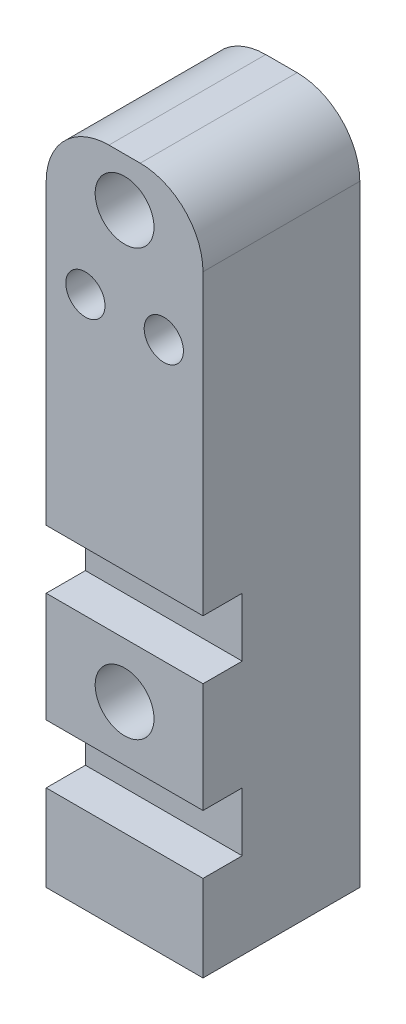
ISO-10303-21;
HEADER;
FILE_DESCRIPTION(('STEP AP214'),'2;1');
FILE_NAME('part.step','',(''),(''),'','','');
FILE_SCHEMA(('AUTOMOTIVE_DESIGN { 1 0 10303 214 1 1 1 1 }'));
ENDSEC;
DATA;
#1=APPLICATION_CONTEXT('core data for automotive mechanical design processes');
#2=APPLICATION_PROTOCOL_DEFINITION('international standard','automotive_design',2000,#1);
#3=PRODUCT_CONTEXT('',#1,'mechanical');
#4=PRODUCT('Part','Part','',(#3));
#5=PRODUCT_RELATED_PRODUCT_CATEGORY('part','',(#4));
#6=PRODUCT_DEFINITION_FORMATION('','',#4);
#7=PRODUCT_DEFINITION_CONTEXT('part definition',#1,'design');
#8=PRODUCT_DEFINITION('design','',#6,#7);
#9=PRODUCT_DEFINITION_SHAPE('','',#8);
#10=(LENGTH_UNIT() NAMED_UNIT(*) SI_UNIT(.MILLI.,.METRE.));
#11=(NAMED_UNIT(*) PLANE_ANGLE_UNIT() SI_UNIT($,.RADIAN.));
#12=(NAMED_UNIT(*) SI_UNIT($,.STERADIAN.) SOLID_ANGLE_UNIT());
#13=UNCERTAINTY_MEASURE_WITH_UNIT(LENGTH_MEASURE(1.E-05),#10,'distance_accuracy_value','');
#14=(GEOMETRIC_REPRESENTATION_CONTEXT(3) GLOBAL_UNCERTAINTY_ASSIGNED_CONTEXT((#13)) GLOBAL_UNIT_ASSIGNED_CONTEXT((#10,
#11,#12)) REPRESENTATION_CONTEXT('',''));
#15=CARTESIAN_POINT('',(0.,0.,0.));
#16=DIRECTION('',(0.,0.,1.));
#17=DIRECTION('',(1.,0.,0.));
#18=AXIS2_PLACEMENT_3D('',#15,#16,#17);
#19=CARTESIAN_POINT('',(0.,0.,0.));
#20=DIRECTION('',(0.,0.,1.));
#21=DIRECTION('',(1.,0.,0.));
#22=AXIS2_PLACEMENT_3D('',#19,#20,#21);
#23=PLANE('',#22);
#24=DIRECTION('',(-1.,0.,0.));
#25=VECTOR('',#24,1.);
#26=CARTESIAN_POINT('',(-12.7,50.8,0.));
#27=LINE('',#26,#25);
#28=CARTESIAN_POINT('',(12.7,50.8,0.));
#29=VERTEX_POINT('',#28);
#30=CARTESIAN_POINT('',(-12.7,50.8,0.));
#31=VERTEX_POINT('',#30);
#32=EDGE_CURVE('E156',#29,#31,#27,.T.);
#33=ORIENTED_EDGE('',*,*,#32,.F.);
#34=DIRECTION('',(0.,1.,0.));
#35=VECTOR('',#34,1.);
#36=CARTESIAN_POINT('',(12.7,0.,0.));
#37=LINE('',#36,#35);
#38=CARTESIAN_POINT('',(12.7,99.0599999999999,0.));
#39=VERTEX_POINT('',#38);
#40=EDGE_CURVE('E250',#29,#39,#37,.T.);
#41=ORIENTED_EDGE('',*,*,#40,.T.);
#42=CARTESIAN_POINT('',(2.54,99.06,0.));
#43=DIRECTION('',(0.,0.,1.));
#44=DIRECTION('',(1.,0.,0.));
#45=AXIS2_PLACEMENT_3D('',#42,#43,#44);
#46=CIRCLE('',#45,10.16);
#47=CARTESIAN_POINT('',(2.53999999999993,109.22,0.));
#48=VERTEX_POINT('',#47);
#49=EDGE_CURVE('E254',#48,#39,#46,.F.);
#50=ORIENTED_EDGE('',*,*,#49,.F.);
#51=DIRECTION('',(1.,0.,0.));
#52=VECTOR('',#51,1.);
#53=CARTESIAN_POINT('',(0.,109.22,0.));
#54=LINE('',#53,#52);
#55=CARTESIAN_POINT('',(-2.53999999999993,109.22,0.));
#56=VERTEX_POINT('',#55);
#57=EDGE_CURVE('E211',#56,#48,#54,.T.);
#58=ORIENTED_EDGE('',*,*,#57,.F.);
#59=CARTESIAN_POINT('',(-2.54,99.06,0.));
#60=DIRECTION('',(0.,0.,1.));
#61=DIRECTION('',(1.,0.,0.));
#62=AXIS2_PLACEMENT_3D('',#59,#60,#61);
#63=CIRCLE('',#62,10.16);
#64=CARTESIAN_POINT('',(-12.7,99.0599999999999,0.));
#65=VERTEX_POINT('',#64);
#66=EDGE_CURVE('E240',#65,#56,#63,.F.);
#67=ORIENTED_EDGE('',*,*,#66,.F.);
#68=DIRECTION('',(0.,1.,0.));
#69=VECTOR('',#68,1.);
#70=CARTESIAN_POINT('',(-12.7,0.,0.));
#71=LINE('',#70,#69);
#72=EDGE_CURVE('E243',#31,#65,#71,.T.);
#73=ORIENTED_EDGE('',*,*,#72,.F.);
#74=EDGE_LOOP('',(#33,#41,#50,#58,#67,#73));
#75=FACE_BOUND('',#74,.T.);
#76=CARTESIAN_POINT('',(-6.35,86.36,0.));
#77=DIRECTION('',(0.,0.,1.));
#78=DIRECTION('',(1.,0.,0.));
#79=AXIS2_PLACEMENT_3D('',#76,#77,#78);
#80=CIRCLE('',#79,3.175);
#81=CARTESIAN_POINT('',(-3.175,86.36,0.));
#82=VERTEX_POINT('',#81);
#83=EDGE_CURVE('E234',#82,#82,#80,.T.);
#84=ORIENTED_EDGE('',*,*,#83,.F.);
#85=EDGE_LOOP('',(#84));
#86=FACE_BOUND('',#85,.T.);
#87=CARTESIAN_POINT('',(6.35,86.36,0.));
#88=DIRECTION('',(0.,0.,1.));
#89=DIRECTION('',(1.,0.,0.));
#90=AXIS2_PLACEMENT_3D('',#87,#88,#89);
#91=CIRCLE('',#90,3.175);
#92=CARTESIAN_POINT('',(9.525,86.36,0.));
#93=VERTEX_POINT('',#92);
#94=EDGE_CURVE('E204',#93,#93,#91,.T.);
#95=ORIENTED_EDGE('',*,*,#94,.F.);
#96=EDGE_LOOP('',(#95));
#97=FACE_BOUND('',#96,.T.);
#98=CARTESIAN_POINT('',(0.,101.346,0.));
#99=DIRECTION('',(0.,0.,1.));
#100=DIRECTION('',(1.,0.,0.));
#101=AXIS2_PLACEMENT_3D('',#98,#99,#100);
#102=CIRCLE('',#101,4.7625);
#103=CARTESIAN_POINT('',(4.7625,101.346,0.));
#104=VERTEX_POINT('',#103);
#105=EDGE_CURVE('E196',#104,#104,#102,.T.);
#106=ORIENTED_EDGE('',*,*,#105,.F.);
#107=EDGE_LOOP('',(#106));
#108=FACE_BOUND('',#107,.T.);
#109=ADVANCED_FACE('F38',(#75,#86,#97,#108),#23,.T.);
#110=DIRECTION('',(1.,0.,0.));
#111=VECTOR('',#110,1.);
#112=CARTESIAN_POINT('',(-12.7,41.275,0.));
#113=LINE('',#112,#111);
#114=CARTESIAN_POINT('',(-12.7,41.275,0.));
#115=VERTEX_POINT('',#114);
#116=CARTESIAN_POINT('',(12.7,41.275,0.));
#117=VERTEX_POINT('',#116);
#118=EDGE_CURVE('E186',#115,#117,#113,.T.);
#119=ORIENTED_EDGE('',*,*,#118,.F.);
#120=CARTESIAN_POINT('',(-12.7,23.495,0.));
#121=VERTEX_POINT('',#120);
#122=EDGE_CURVE('E162',#121,#115,#71,.T.);
#123=ORIENTED_EDGE('',*,*,#122,.F.);
#124=DIRECTION('',(-1.,0.,0.));
#125=VECTOR('',#124,1.);
#126=CARTESIAN_POINT('',(-12.7,23.495,0.));
#127=LINE('',#126,#125);
#128=CARTESIAN_POINT('',(12.7,23.495,0.));
#129=VERTEX_POINT('',#128);
#130=EDGE_CURVE('E173',#129,#121,#127,.T.);
#131=ORIENTED_EDGE('',*,*,#130,.F.);
#132=EDGE_CURVE('E255',#129,#117,#37,.T.);
#133=ORIENTED_EDGE('',*,*,#132,.T.);
#134=EDGE_LOOP('',(#119,#123,#131,#133));
#135=FACE_BOUND('',#134,.T.);
#136=CARTESIAN_POINT('',(0.,32.385,0.));
#137=DIRECTION('',(0.,0.,1.));
#138=DIRECTION('',(1.,0.,0.));
#139=AXIS2_PLACEMENT_3D('',#136,#137,#138);
#140=CIRCLE('',#139,4.7625);
#141=CARTESIAN_POINT('',(4.7625,32.385,0.));
#142=VERTEX_POINT('',#141);
#143=EDGE_CURVE('E237',#142,#142,#140,.T.);
#144=ORIENTED_EDGE('',*,*,#143,.F.);
#145=EDGE_LOOP('',(#144));
#146=FACE_BOUND('',#145,.T.);
#147=ADVANCED_FACE('F322',(#135,#146),#23,.T.);
#148=CARTESIAN_POINT('',(-2.54,99.06,-25.4));
#149=DIRECTION('',(0.,0.,1.));
#150=DIRECTION('',(1.,0.,0.));
#151=AXIS2_PLACEMENT_3D('',#148,#149,#150);
#152=CYLINDRICAL_SURFACE('',#151,10.16);
#153=ORIENTED_EDGE('',*,*,#66,.T.);
#154=DIRECTION('',(0.,0.,1.));
#155=VECTOR('',#154,1.);
#156=CARTESIAN_POINT('',(-2.53999999999993,109.22,-25.4));
#157=LINE('',#156,#155);
#158=CARTESIAN_POINT('',(-2.53999999999993,109.22,-25.4));
#159=VERTEX_POINT('',#158);
#160=EDGE_CURVE('E11',#159,#56,#157,.T.);
#161=ORIENTED_EDGE('',*,*,#160,.F.);
#162=CARTESIAN_POINT('',(-2.54,99.06,-25.4));
#163=DIRECTION('',(0.,0.,1.));
#164=DIRECTION('',(1.,0.,0.));
#165=AXIS2_PLACEMENT_3D('',#162,#163,#164);
#166=CIRCLE('',#165,10.16);
#167=CARTESIAN_POINT('',(-12.7,99.0599999999999,-25.4));
#168=VERTEX_POINT('',#167);
#169=EDGE_CURVE('E217',#168,#159,#166,.F.);
#170=ORIENTED_EDGE('',*,*,#169,.F.);
#171=DIRECTION('',(0.,0.,1.));
#172=VECTOR('',#171,1.);
#173=CARTESIAN_POINT('',(-12.7,99.0599999999999,-25.4));
#174=LINE('',#173,#172);
#175=EDGE_CURVE('E42',#168,#65,#174,.T.);
#176=ORIENTED_EDGE('',*,*,#175,.T.);
#177=EDGE_LOOP('',(#153,#161,#170,#176));
#178=FACE_BOUND('',#177,.T.);
#179=ADVANCED_FACE('F273',(#178),#152,.T.);
#180=CARTESIAN_POINT('',(0.,109.22,-25.4));
#181=DIRECTION('',(0.,-1.,0.));
#182=DIRECTION('',(0.,0.,-1.));
#183=AXIS2_PLACEMENT_3D('',#180,#181,#182);
#184=PLANE('',#183);
#185=ORIENTED_EDGE('',*,*,#57,.T.);
#186=DIRECTION('',(0.,0.,1.));
#187=VECTOR('',#186,1.);
#188=CARTESIAN_POINT('',(2.53999999999993,109.22,-25.4));
#189=LINE('',#188,#187);
#190=CARTESIAN_POINT('',(2.53999999999993,109.22,-25.4));
#191=VERTEX_POINT('',#190);
#192=EDGE_CURVE('E47',#191,#48,#189,.T.);
#193=ORIENTED_EDGE('',*,*,#192,.F.);
#194=DIRECTION('',(1.,0.,0.));
#195=VECTOR('',#194,1.);
#196=CARTESIAN_POINT('',(0.,109.22,-25.4));
#197=LINE('',#196,#195);
#198=EDGE_CURVE('E230',#159,#191,#197,.T.);
#199=ORIENTED_EDGE('',*,*,#198,.F.);
#200=ORIENTED_EDGE('',*,*,#160,.T.);
#201=EDGE_LOOP('',(#185,#193,#199,#200));
#202=FACE_BOUND('',#201,.T.);
#203=ADVANCED_FACE('F282',(#202),#184,.F.);
#204=CARTESIAN_POINT('',(2.54,99.06,-25.4));
#205=DIRECTION('',(0.,0.,1.));
#206=DIRECTION('',(1.,0.,0.));
#207=AXIS2_PLACEMENT_3D('',#204,#205,#206);
#208=CYLINDRICAL_SURFACE('',#207,10.16);
#209=ORIENTED_EDGE('',*,*,#49,.T.);
#210=DIRECTION('',(0.,0.,1.));
#211=VECTOR('',#210,1.);
#212=CARTESIAN_POINT('',(12.7,99.0599999999999,-25.4));
#213=LINE('',#212,#211);
#214=CARTESIAN_POINT('',(12.7,99.0599999999999,-25.4));
#215=VERTEX_POINT('',#214);
#216=EDGE_CURVE('E261',#215,#39,#213,.T.);
#217=ORIENTED_EDGE('',*,*,#216,.F.);
#218=CARTESIAN_POINT('',(2.54,99.06,-25.4));
#219=DIRECTION('',(0.,0.,1.));
#220=DIRECTION('',(1.,0.,0.));
#221=AXIS2_PLACEMENT_3D('',#218,#219,#220);
#222=CIRCLE('',#221,10.16);
#223=EDGE_CURVE('E228',#191,#215,#222,.F.);
#224=ORIENTED_EDGE('',*,*,#223,.F.);
#225=ORIENTED_EDGE('',*,*,#192,.T.);
#226=EDGE_LOOP('',(#209,#217,#224,#225));
#227=FACE_BOUND('',#226,.T.);
#228=ADVANCED_FACE('F312',(#227),#208,.T.);
#229=CARTESIAN_POINT('',(12.7,0.,-25.4));
#230=DIRECTION('',(1.,0.,0.));
#231=DIRECTION('',(0.,0.,-1.));
#232=AXIS2_PLACEMENT_3D('',#229,#230,#231);
#233=PLANE('',#232);
#234=DIRECTION('',(0.,0.,1.));
#235=VECTOR('',#234,1.);
#236=CARTESIAN_POINT('',(12.7,50.8,-6.35));
#237=LINE('',#236,#235);
#238=CARTESIAN_POINT('',(12.7,50.8,-6.35));
#239=VERTEX_POINT('',#238);
#240=EDGE_CURVE('E164',#239,#29,#237,.T.);
#241=ORIENTED_EDGE('',*,*,#240,.F.);
#242=DIRECTION('',(0.,1.,0.));
#243=VECTOR('',#242,1.);
#244=CARTESIAN_POINT('',(12.7,41.275,-6.35));
#245=LINE('',#244,#243);
#246=CARTESIAN_POINT('',(12.7,41.275,-6.35));
#247=VERTEX_POINT('',#246);
#248=EDGE_CURVE('E146',#247,#239,#245,.T.);
#249=ORIENTED_EDGE('',*,*,#248,.F.);
#250=DIRECTION('',(0.,0.,1.));
#251=VECTOR('',#250,1.);
#252=CARTESIAN_POINT('',(12.7,41.275,-6.35));
#253=LINE('',#252,#251);
#254=EDGE_CURVE('E143',#247,#117,#253,.T.);
#255=ORIENTED_EDGE('',*,*,#254,.T.);
#256=ORIENTED_EDGE('',*,*,#132,.F.);
#257=DIRECTION('',(0.,0.,1.));
#258=VECTOR('',#257,1.);
#259=CARTESIAN_POINT('',(12.7,23.495,-6.35));
#260=LINE('',#259,#258);
#261=CARTESIAN_POINT('',(12.7,23.495,-6.35));
#262=VERTEX_POINT('',#261);
#263=EDGE_CURVE('E187',#262,#129,#260,.T.);
#264=ORIENTED_EDGE('',*,*,#263,.F.);
#265=DIRECTION('',(0.,1.,0.));
#266=VECTOR('',#265,1.);
#267=CARTESIAN_POINT('',(12.7,13.97,-6.35));
#268=LINE('',#267,#266);
#269=CARTESIAN_POINT('',(12.7,13.97,-6.35));
#270=VERTEX_POINT('',#269);
#271=EDGE_CURVE('E176',#270,#262,#268,.T.);
#272=ORIENTED_EDGE('',*,*,#271,.F.);
#273=DIRECTION('',(0.,0.,1.));
#274=VECTOR('',#273,1.);
#275=CARTESIAN_POINT('',(12.7,13.97,-6.35));
#276=LINE('',#275,#274);
#277=CARTESIAN_POINT('',(12.7,13.97,0.));
#278=VERTEX_POINT('',#277);
#279=EDGE_CURVE('E189',#270,#278,#276,.T.);
#280=ORIENTED_EDGE('',*,*,#279,.T.);
#281=CARTESIAN_POINT('',(12.7,0.,0.));
#282=VERTEX_POINT('',#281);
#283=EDGE_CURVE('E251',#282,#278,#37,.T.);
#284=ORIENTED_EDGE('',*,*,#283,.F.);
#285=DIRECTION('',(0.,0.,1.));
#286=VECTOR('',#285,1.);
#287=CARTESIAN_POINT('',(12.7,0.,-25.4));
#288=LINE('',#287,#286);
#289=CARTESIAN_POINT('',(12.7,0.,-25.4));
#290=VERTEX_POINT('',#289);
#291=EDGE_CURVE('E264',#290,#282,#288,.T.);
#292=ORIENTED_EDGE('',*,*,#291,.F.);
#293=DIRECTION('',(0.,1.,0.));
#294=VECTOR('',#293,1.);
#295=CARTESIAN_POINT('',(12.7,0.,-25.4));
#296=LINE('',#295,#294);
#297=EDGE_CURVE('E225',#290,#215,#296,.T.);
#298=ORIENTED_EDGE('',*,*,#297,.T.);
#299=ORIENTED_EDGE('',*,*,#216,.T.);
#300=ORIENTED_EDGE('',*,*,#40,.F.);
#301=EDGE_LOOP('',(#241,#249,#255,#256,#264,#272,#280,#284,#292,#298,#299,#300));
#302=FACE_BOUND('',#301,.T.);
#303=ADVANCED_FACE('F306',(#302),#233,.T.);
#304=CARTESIAN_POINT('',(0.,0.,-25.4));
#305=DIRECTION('',(0.,-1.,0.));
#306=DIRECTION('',(0.,0.,-1.));
#307=AXIS2_PLACEMENT_3D('',#304,#305,#306);
#308=PLANE('',#307);
#309=CARTESIAN_POINT('',(0.,0.,-12.7));
#310=DIRECTION('',(0.,-1.,0.));
#311=DIRECTION('',(0.,0.,-1.));
#312=AXIS2_PLACEMENT_3D('',#309,#310,#311);
#313=CIRCLE('',#312,3.175);
#314=CARTESIAN_POINT('',(0.,0.,-15.875));
#315=VERTEX_POINT('',#314);
#316=EDGE_CURVE('E197',#315,#315,#313,.T.);
#317=ORIENTED_EDGE('',*,*,#316,.F.);
#318=EDGE_LOOP('',(#317));
#319=FACE_BOUND('',#318,.T.);
#320=DIRECTION('',(1.,0.,0.));
#321=VECTOR('',#320,1.);
#322=CARTESIAN_POINT('',(0.,0.,0.));
#323=LINE('',#322,#321);
#324=CARTESIAN_POINT('',(-12.7,0.,0.));
#325=VERTEX_POINT('',#324);
#326=EDGE_CURVE('E247',#325,#282,#323,.T.);
#327=ORIENTED_EDGE('',*,*,#326,.F.);
#328=DIRECTION('',(0.,0.,1.));
#329=VECTOR('',#328,1.);
#330=CARTESIAN_POINT('',(-12.7,0.,-25.4));
#331=LINE('',#330,#329);
#332=CARTESIAN_POINT('',(-12.7,0.,-25.4));
#333=VERTEX_POINT('',#332);
#334=EDGE_CURVE('E265',#333,#325,#331,.T.);
#335=ORIENTED_EDGE('',*,*,#334,.F.);
#336=DIRECTION('',(1.,0.,0.));
#337=VECTOR('',#336,1.);
#338=CARTESIAN_POINT('',(0.,0.,-25.4));
#339=LINE('',#338,#337);
#340=EDGE_CURVE('E222',#333,#290,#339,.T.);
#341=ORIENTED_EDGE('',*,*,#340,.T.);
#342=ORIENTED_EDGE('',*,*,#291,.T.);
#343=EDGE_LOOP('',(#327,#335,#341,#342));
#344=FACE_BOUND('',#343,.T.);
#345=ADVANCED_FACE('F290',(#319,#344),#308,.T.);
#346=CARTESIAN_POINT('',(0.,32.385,-25.4));
#347=DIRECTION('',(0.,0.,1.));
#348=DIRECTION('',(1.,0.,0.));
#349=AXIS2_PLACEMENT_3D('',#346,#347,#348);
#350=CYLINDRICAL_SURFACE('',#349,4.7625);
#351=CARTESIAN_POINT('',(0.,32.385,-25.4));
#352=DIRECTION('',(0.,0.,1.));
#353=DIRECTION('',(1.,0.,0.));
#354=AXIS2_PLACEMENT_3D('',#351,#352,#353);
#355=CIRCLE('',#354,4.7625);
#356=CARTESIAN_POINT('',(4.7625,32.385,-25.4));
#357=VERTEX_POINT('',#356);
#358=EDGE_CURVE('E214',#357,#357,#355,.T.);
#359=ORIENTED_EDGE('',*,*,#358,.F.);
#360=EDGE_LOOP('',(#359));
#361=FACE_BOUND('',#360,.T.);
#362=ORIENTED_EDGE('',*,*,#143,.T.);
#363=EDGE_LOOP('',(#362));
#364=FACE_BOUND('',#363,.T.);
#365=ADVANCED_FACE('F432',(#361,#364),#350,.F.);
#366=CARTESIAN_POINT('',(-6.35,86.36,-25.4));
#367=DIRECTION('',(0.,0.,1.));
#368=DIRECTION('',(1.,0.,0.));
#369=AXIS2_PLACEMENT_3D('',#366,#367,#368);
#370=CYLINDRICAL_SURFACE('',#369,3.175);
#371=CARTESIAN_POINT('',(-6.35,86.36,-25.4));
#372=DIRECTION('',(0.,0.,1.));
#373=DIRECTION('',(1.,0.,0.));
#374=AXIS2_PLACEMENT_3D('',#371,#372,#373);
#375=CIRCLE('',#374,3.175);
#376=CARTESIAN_POINT('',(-3.175,86.36,-25.4));
#377=VERTEX_POINT('',#376);
#378=EDGE_CURVE('E210',#377,#377,#375,.T.);
#379=ORIENTED_EDGE('',*,*,#378,.F.);
#380=EDGE_LOOP('',(#379));
#381=FACE_BOUND('',#380,.T.);
#382=ORIENTED_EDGE('',*,*,#83,.T.);
#383=EDGE_LOOP('',(#382));
#384=FACE_BOUND('',#383,.T.);
#385=ADVANCED_FACE('F423',(#381,#384),#370,.F.);
#386=CARTESIAN_POINT('',(6.35,86.36,-25.4));
#387=DIRECTION('',(0.,0.,1.));
#388=DIRECTION('',(1.,0.,0.));
#389=AXIS2_PLACEMENT_3D('',#386,#387,#388);
#390=CYLINDRICAL_SURFACE('',#389,3.175);
#391=CARTESIAN_POINT('',(6.35,86.36,-25.4));
#392=DIRECTION('',(0.,0.,1.));
#393=DIRECTION('',(1.,0.,0.));
#394=AXIS2_PLACEMENT_3D('',#391,#392,#393);
#395=CIRCLE('',#394,3.175);
#396=CARTESIAN_POINT('',(9.525,86.36,-25.4));
#397=VERTEX_POINT('',#396);
#398=EDGE_CURVE('E207',#397,#397,#395,.T.);
#399=ORIENTED_EDGE('',*,*,#398,.F.);
#400=EDGE_LOOP('',(#399));
#401=FACE_BOUND('',#400,.T.);
#402=ORIENTED_EDGE('',*,*,#94,.T.);
#403=EDGE_LOOP('',(#402));
#404=FACE_BOUND('',#403,.T.);
#405=ADVANCED_FACE('F40',(#401,#404),#390,.F.);
#406=CARTESIAN_POINT('',(-12.7,0.,-25.4));
#407=DIRECTION('',(1.,0.,0.));
#408=DIRECTION('',(0.,0.,-1.));
#409=AXIS2_PLACEMENT_3D('',#406,#407,#408);
#410=PLANE('',#409);
#411=DIRECTION('',(0.,-1.,0.));
#412=VECTOR('',#411,1.);
#413=CARTESIAN_POINT('',(-12.7,41.275,-6.35));
#414=LINE('',#413,#412);
#415=CARTESIAN_POINT('',(-12.7,50.8,-6.35));
#416=VERTEX_POINT('',#415);
#417=CARTESIAN_POINT('',(-12.7,41.275,-6.35));
#418=VERTEX_POINT('',#417);
#419=EDGE_CURVE('E147',#416,#418,#414,.T.);
#420=ORIENTED_EDGE('',*,*,#419,.F.);
#421=DIRECTION('',(0.,0.,1.));
#422=VECTOR('',#421,1.);
#423=CARTESIAN_POINT('',(-12.7,50.8,-6.35));
#424=LINE('',#423,#422);
#425=EDGE_CURVE('E200',#416,#31,#424,.T.);
#426=ORIENTED_EDGE('',*,*,#425,.T.);
#427=ORIENTED_EDGE('',*,*,#72,.T.);
#428=ORIENTED_EDGE('',*,*,#175,.F.);
#429=DIRECTION('',(0.,1.,0.));
#430=VECTOR('',#429,1.);
#431=CARTESIAN_POINT('',(-12.7,0.,-25.4));
#432=LINE('',#431,#430);
#433=EDGE_CURVE('E220',#333,#168,#432,.T.);
#434=ORIENTED_EDGE('',*,*,#433,.F.);
#435=ORIENTED_EDGE('',*,*,#334,.T.);
#436=CARTESIAN_POINT('',(-12.7,13.97,0.));
#437=VERTEX_POINT('',#436);
#438=EDGE_CURVE('E244',#325,#437,#71,.T.);
#439=ORIENTED_EDGE('',*,*,#438,.T.);
#440=DIRECTION('',(0.,0.,1.));
#441=VECTOR('',#440,1.);
#442=CARTESIAN_POINT('',(-12.7,13.97,-6.35));
#443=LINE('',#442,#441);
#444=CARTESIAN_POINT('',(-12.7,13.97,-6.35));
#445=VERTEX_POINT('',#444);
#446=EDGE_CURVE('E63',#445,#437,#443,.T.);
#447=ORIENTED_EDGE('',*,*,#446,.F.);
#448=DIRECTION('',(0.,-1.,0.));
#449=VECTOR('',#448,1.);
#450=CARTESIAN_POINT('',(-12.7,13.97,-6.35));
#451=LINE('',#450,#449);
#452=CARTESIAN_POINT('',(-12.7,23.495,-6.35));
#453=VERTEX_POINT('',#452);
#454=EDGE_CURVE('E169',#453,#445,#451,.T.);
#455=ORIENTED_EDGE('',*,*,#454,.F.);
#456=DIRECTION('',(0.,0.,1.));
#457=VECTOR('',#456,1.);
#458=CARTESIAN_POINT('',(-12.7,23.495,-6.35));
#459=LINE('',#458,#457);
#460=EDGE_CURVE('E184',#453,#121,#459,.T.);
#461=ORIENTED_EDGE('',*,*,#460,.T.);
#462=ORIENTED_EDGE('',*,*,#122,.T.);
#463=DIRECTION('',(0.,0.,1.));
#464=VECTOR('',#463,1.);
#465=CARTESIAN_POINT('',(-12.7,41.275,-6.35));
#466=LINE('',#465,#464);
#467=EDGE_CURVE('E55',#418,#115,#466,.T.);
#468=ORIENTED_EDGE('',*,*,#467,.F.);
#469=EDGE_LOOP('',(#420,#426,#427,#428,#434,#435,#439,#447,#455,#461,#462,#468));
#470=FACE_BOUND('',#469,.T.);
#471=ADVANCED_FACE('F159',(#470),#410,.F.);
#472=CARTESIAN_POINT('',(0.,0.,-25.4));
#473=DIRECTION('',(0.,0.,1.));
#474=DIRECTION('',(1.,0.,0.));
#475=AXIS2_PLACEMENT_3D('',#472,#473,#474);
#476=PLANE('',#475);
#477=ORIENTED_EDGE('',*,*,#398,.T.);
#478=EDGE_LOOP('',(#477));
#479=FACE_BOUND('',#478,.T.);
#480=ORIENTED_EDGE('',*,*,#378,.T.);
#481=EDGE_LOOP('',(#480));
#482=FACE_BOUND('',#481,.T.);
#483=ORIENTED_EDGE('',*,*,#358,.T.);
#484=EDGE_LOOP('',(#483));
#485=FACE_BOUND('',#484,.T.);
#486=ORIENTED_EDGE('',*,*,#169,.T.);
#487=ORIENTED_EDGE('',*,*,#198,.T.);
#488=ORIENTED_EDGE('',*,*,#223,.T.);
#489=ORIENTED_EDGE('',*,*,#297,.F.);
#490=ORIENTED_EDGE('',*,*,#340,.F.);
#491=ORIENTED_EDGE('',*,*,#433,.T.);
#492=EDGE_LOOP('',(#486,#487,#488,#489,#490,#491));
#493=FACE_BOUND('',#492,.T.);
#494=ADVANCED_FACE('F285',(#479,#482,#485,#493),#476,.F.);
#495=DIRECTION('',(1.,0.,0.));
#496=VECTOR('',#495,1.);
#497=CARTESIAN_POINT('',(-12.7,13.97,0.));
#498=LINE('',#497,#496);
#499=EDGE_CURVE('E181',#437,#278,#498,.T.);
#500=ORIENTED_EDGE('',*,*,#499,.F.);
#501=ORIENTED_EDGE('',*,*,#438,.F.);
#502=ORIENTED_EDGE('',*,*,#326,.T.);
#503=ORIENTED_EDGE('',*,*,#283,.T.);
#504=EDGE_LOOP('',(#500,#501,#502,#503));
#505=FACE_BOUND('',#504,.T.);
#506=ADVANCED_FACE('F293',(#505),#23,.T.);
#507=CARTESIAN_POINT('',(0.,101.346,-16.51));
#508=DIRECTION('',(0.,0.,1.));
#509=DIRECTION('',(1.,0.,0.));
#510=AXIS2_PLACEMENT_3D('',#507,#508,#509);
#511=CYLINDRICAL_SURFACE('',#510,4.7625);
#512=CARTESIAN_POINT('',(0.,101.346,-16.51));
#513=DIRECTION('',(0.,0.,1.));
#514=DIRECTION('',(1.,0.,0.));
#515=AXIS2_PLACEMENT_3D('',#512,#513,#514);
#516=CIRCLE('',#515,4.7625);
#517=CARTESIAN_POINT('',(4.7625,101.346,-16.51));
#518=VERTEX_POINT('',#517);
#519=EDGE_CURVE('E201',#518,#518,#516,.T.);
#520=ORIENTED_EDGE('',*,*,#519,.F.);
#521=EDGE_LOOP('',(#520));
#522=FACE_BOUND('',#521,.T.);
#523=ORIENTED_EDGE('',*,*,#105,.T.);
#524=EDGE_LOOP('',(#523));
#525=FACE_BOUND('',#524,.T.);
#526=ADVANCED_FACE('F329',(#522,#525),#511,.F.);
#527=CARTESIAN_POINT('',(0.,0.,-16.51));
#528=DIRECTION('',(0.,0.,1.));
#529=DIRECTION('',(1.,0.,0.));
#530=AXIS2_PLACEMENT_3D('',#527,#528,#529);
#531=PLANE('',#530);
#532=ORIENTED_EDGE('',*,*,#519,.T.);
#533=EDGE_LOOP('',(#532));
#534=FACE_BOUND('',#533,.T.);
#535=ADVANCED_FACE('F334',(#534),#531,.T.);
#536=CARTESIAN_POINT('',(0.,17.78,-12.7));
#537=DIRECTION('',(0.,-1.,0.));
#538=DIRECTION('',(0.,0.,-1.));
#539=AXIS2_PLACEMENT_3D('',#536,#537,#538);
#540=CYLINDRICAL_SURFACE('',#539,3.175);
#541=CARTESIAN_POINT('',(0.,17.78,-12.7));
#542=DIRECTION('',(0.,-1.,0.));
#543=DIRECTION('',(0.,0.,-1.));
#544=AXIS2_PLACEMENT_3D('',#541,#542,#543);
#545=CIRCLE('',#544,3.175);
#546=CARTESIAN_POINT('',(0.,17.78,-15.875));
#547=VERTEX_POINT('',#546);
#548=EDGE_CURVE('E193',#547,#547,#545,.T.);
#549=ORIENTED_EDGE('',*,*,#548,.F.);
#550=EDGE_LOOP('',(#549));
#551=FACE_BOUND('',#550,.T.);
#552=ORIENTED_EDGE('',*,*,#316,.T.);
#553=EDGE_LOOP('',(#552));
#554=FACE_BOUND('',#553,.T.);
#555=ADVANCED_FACE('F346',(#551,#554),#540,.F.);
#556=CARTESIAN_POINT('',(0.,17.78,-12.7));
#557=DIRECTION('',(0.,-1.,0.));
#558=DIRECTION('',(0.,0.,-1.));
#559=AXIS2_PLACEMENT_3D('',#556,#557,#558);
#560=PLANE('',#559);
#561=ORIENTED_EDGE('',*,*,#548,.T.);
#562=EDGE_LOOP('',(#561));
#563=FACE_BOUND('',#562,.T.);
#564=ADVANCED_FACE('F350',(#563),#560,.T.);
#565=CARTESIAN_POINT('',(-12.7,23.495,-6.35));
#566=DIRECTION('',(0.,1.,0.));
#567=DIRECTION('',(0.,0.,1.));
#568=AXIS2_PLACEMENT_3D('',#565,#566,#567);
#569=PLANE('',#568);
#570=ORIENTED_EDGE('',*,*,#130,.T.);
#571=ORIENTED_EDGE('',*,*,#460,.F.);
#572=DIRECTION('',(-1.,0.,0.));
#573=VECTOR('',#572,1.);
#574=CARTESIAN_POINT('',(-12.7,23.495,-6.35));
#575=LINE('',#574,#573);
#576=EDGE_CURVE('E178',#262,#453,#575,.T.);
#577=ORIENTED_EDGE('',*,*,#576,.F.);
#578=ORIENTED_EDGE('',*,*,#263,.T.);
#579=EDGE_LOOP('',(#570,#571,#577,#578));
#580=FACE_BOUND('',#579,.T.);
#581=ADVANCED_FACE('F301',(#580),#569,.F.);
#582=CARTESIAN_POINT('',(-12.7,13.97,-6.35));
#583=DIRECTION('',(0.,-1.,0.));
#584=DIRECTION('',(0.,0.,-1.));
#585=AXIS2_PLACEMENT_3D('',#582,#583,#584);
#586=PLANE('',#585);
#587=ORIENTED_EDGE('',*,*,#499,.T.);
#588=ORIENTED_EDGE('',*,*,#279,.F.);
#589=DIRECTION('',(1.,0.,0.));
#590=VECTOR('',#589,1.);
#591=CARTESIAN_POINT('',(-12.7,13.97,-6.35));
#592=LINE('',#591,#590);
#593=EDGE_CURVE('E172',#445,#270,#592,.T.);
#594=ORIENTED_EDGE('',*,*,#593,.F.);
#595=ORIENTED_EDGE('',*,*,#446,.T.);
#596=EDGE_LOOP('',(#587,#588,#594,#595));
#597=FACE_BOUND('',#596,.T.);
#598=ADVANCED_FACE('F355',(#597),#586,.F.);
#599=CARTESIAN_POINT('',(0.,0.,-6.35));
#600=DIRECTION('',(0.,0.,-1.));
#601=DIRECTION('',(-1.,0.,0.));
#602=AXIS2_PLACEMENT_3D('',#599,#600,#601);
#603=PLANE('',#602);
#604=ORIENTED_EDGE('',*,*,#454,.T.);
#605=ORIENTED_EDGE('',*,*,#593,.T.);
#606=ORIENTED_EDGE('',*,*,#271,.T.);
#607=ORIENTED_EDGE('',*,*,#576,.T.);
#608=EDGE_LOOP('',(#604,#605,#606,#607));
#609=FACE_BOUND('',#608,.T.);
#610=ADVANCED_FACE('F296',(#609),#603,.F.);
#611=CARTESIAN_POINT('',(-12.7,50.8,-6.35));
#612=DIRECTION('',(0.,1.,0.));
#613=DIRECTION('',(0.,0.,1.));
#614=AXIS2_PLACEMENT_3D('',#611,#612,#613);
#615=PLANE('',#614);
#616=ORIENTED_EDGE('',*,*,#32,.T.);
#617=ORIENTED_EDGE('',*,*,#425,.F.);
#618=DIRECTION('',(-1.,0.,0.));
#619=VECTOR('',#618,1.);
#620=CARTESIAN_POINT('',(-12.7,50.8,-6.35));
#621=LINE('',#620,#619);
#622=EDGE_CURVE('E153',#239,#416,#621,.T.);
#623=ORIENTED_EDGE('',*,*,#622,.F.);
#624=ORIENTED_EDGE('',*,*,#240,.T.);
#625=EDGE_LOOP('',(#616,#617,#623,#624));
#626=FACE_BOUND('',#625,.T.);
#627=ADVANCED_FACE('F362',(#626),#615,.F.);
#628=CARTESIAN_POINT('',(-12.7,41.275,-6.35));
#629=DIRECTION('',(0.,-1.,0.));
#630=DIRECTION('',(0.,0.,-1.));
#631=AXIS2_PLACEMENT_3D('',#628,#629,#630);
#632=PLANE('',#631);
#633=ORIENTED_EDGE('',*,*,#118,.T.);
#634=ORIENTED_EDGE('',*,*,#254,.F.);
#635=DIRECTION('',(1.,0.,0.));
#636=VECTOR('',#635,1.);
#637=CARTESIAN_POINT('',(-12.7,41.275,-6.35));
#638=LINE('',#637,#636);
#639=EDGE_CURVE('E139',#418,#247,#638,.T.);
#640=ORIENTED_EDGE('',*,*,#639,.F.);
#641=ORIENTED_EDGE('',*,*,#467,.T.);
#642=EDGE_LOOP('',(#633,#634,#640,#641));
#643=FACE_BOUND('',#642,.T.);
#644=ADVANCED_FACE('F141',(#643),#632,.F.);
#645=CARTESIAN_POINT('',(0.,0.,-6.35));
#646=DIRECTION('',(0.,0.,-1.));
#647=DIRECTION('',(-1.,0.,0.));
#648=AXIS2_PLACEMENT_3D('',#645,#646,#647);
#649=PLANE('',#648);
#650=ORIENTED_EDGE('',*,*,#419,.T.);
#651=ORIENTED_EDGE('',*,*,#639,.T.);
#652=ORIENTED_EDGE('',*,*,#248,.T.);
#653=ORIENTED_EDGE('',*,*,#622,.T.);
#654=EDGE_LOOP('',(#650,#651,#652,#653));
#655=FACE_BOUND('',#654,.T.);
#656=ADVANCED_FACE('F151',(#655),#649,.F.);
#657=CLOSED_SHELL('',(#109,#147,#179,#203,#228,#303,#345,#365,#385,#405,#471,#494,#506,#526,
#535,#555,#564,#581,#598,#610,#627,#644,#656));
#658=MANIFOLD_SOLID_BREP('B2',#657);
#659=ADVANCED_BREP_SHAPE_REPRESENTATION('',(#18,#658),#14);
#660=SHAPE_DEFINITION_REPRESENTATION(#9,#659);
ENDSEC;
END-ISO-10303-21;
